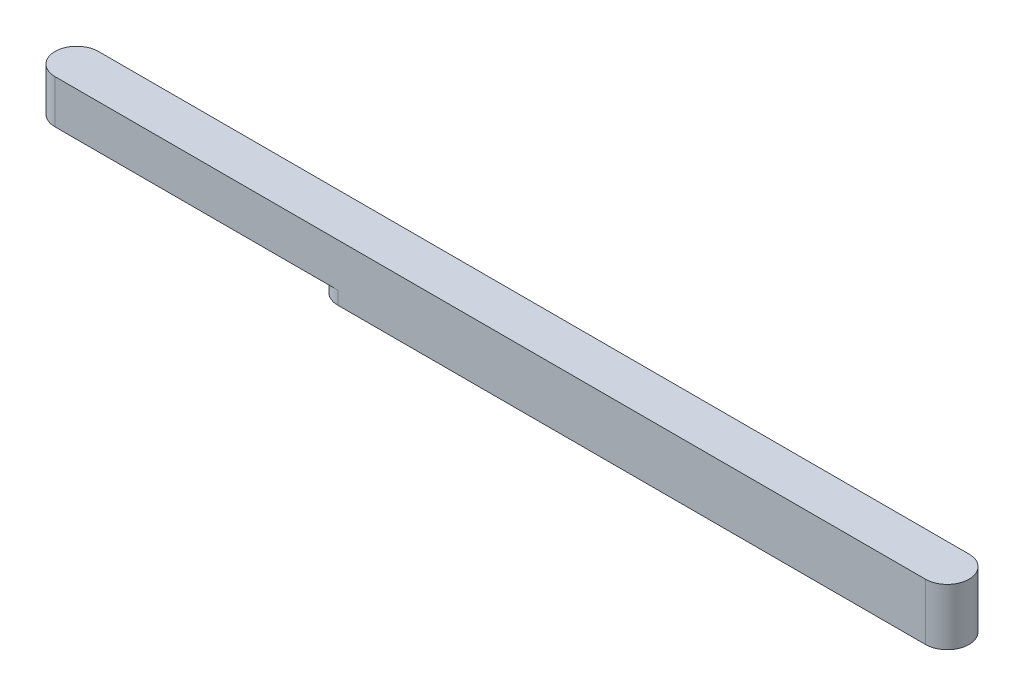
ISO-10303-21;
HEADER;
FILE_DESCRIPTION(('STEP AP214'),'2;1');
FILE_NAME('part.step','',(''),(''),'','','');
FILE_SCHEMA(('AUTOMOTIVE_DESIGN { 1 0 10303 214 1 1 1 1 }'));
ENDSEC;
DATA;
#1=APPLICATION_CONTEXT('core data for automotive mechanical design processes');
#2=APPLICATION_PROTOCOL_DEFINITION('international standard','automotive_design',2000,#1);
#3=PRODUCT_CONTEXT('',#1,'mechanical');
#4=PRODUCT('Part','Part','',(#3));
#5=PRODUCT_RELATED_PRODUCT_CATEGORY('part','',(#4));
#6=PRODUCT_DEFINITION_FORMATION('','',#4);
#7=PRODUCT_DEFINITION_CONTEXT('part definition',#1,'design');
#8=PRODUCT_DEFINITION('design','',#6,#7);
#9=PRODUCT_DEFINITION_SHAPE('','',#8);
#10=(LENGTH_UNIT() NAMED_UNIT(*) SI_UNIT(.MILLI.,.METRE.));
#11=(NAMED_UNIT(*) PLANE_ANGLE_UNIT() SI_UNIT($,.RADIAN.));
#12=(NAMED_UNIT(*) SI_UNIT($,.STERADIAN.) SOLID_ANGLE_UNIT());
#13=UNCERTAINTY_MEASURE_WITH_UNIT(LENGTH_MEASURE(1.E-05),#10,'distance_accuracy_value','');
#14=(GEOMETRIC_REPRESENTATION_CONTEXT(3) GLOBAL_UNCERTAINTY_ASSIGNED_CONTEXT((#13)) GLOBAL_UNIT_ASSIGNED_CONTEXT((#10,
#11,#12)) REPRESENTATION_CONTEXT('',''));
#15=CARTESIAN_POINT('',(0.,0.,0.));
#16=DIRECTION('',(0.,0.,1.));
#17=DIRECTION('',(1.,0.,0.));
#18=AXIS2_PLACEMENT_3D('',#15,#16,#17);
#19=CARTESIAN_POINT('',(-100.,5.,0.));
#20=DIRECTION('',(0.,-1.,0.));
#21=DIRECTION('',(0.,0.,-1.));
#22=AXIS2_PLACEMENT_3D('',#19,#20,#21);
#23=CYLINDRICAL_SURFACE('',#22,5.);
#24=CARTESIAN_POINT('',(-100.,-5.,0.));
#25=DIRECTION('',(0.,1.,0.));
#26=DIRECTION('',(0.,0.,1.));
#27=AXIS2_PLACEMENT_3D('',#24,#25,#26);
#28=CIRCLE('',#27,5.);
#29=CARTESIAN_POINT('',(-100.,-5.,-5.00000000000002));
#30=VERTEX_POINT('',#29);
#31=CARTESIAN_POINT('',(-100.,-5.,4.99999999999998));
#32=VERTEX_POINT('',#31);
#33=EDGE_CURVE('E203',#30,#32,#28,.T.);
#34=ORIENTED_EDGE('',*,*,#33,.T.);
#35=DIRECTION('',(0.,-1.,0.));
#36=VECTOR('',#35,1.);
#37=CARTESIAN_POINT('',(-100.,5.,4.99999999999998));
#38=LINE('',#37,#36);
#39=CARTESIAN_POINT('',(-100.,5.,4.99999999999998));
#40=VERTEX_POINT('',#39);
#41=EDGE_CURVE('E11',#40,#32,#38,.T.);
#42=ORIENTED_EDGE('',*,*,#41,.F.);
#43=CARTESIAN_POINT('',(-100.,5.,0.));
#44=DIRECTION('',(0.,1.,0.));
#45=DIRECTION('',(0.,0.,1.));
#46=AXIS2_PLACEMENT_3D('',#43,#44,#45);
#47=CIRCLE('',#46,5.);
#48=CARTESIAN_POINT('',(-100.,5.,-5.00000000000002));
#49=VERTEX_POINT('',#48);
#50=EDGE_CURVE('E303',#49,#40,#47,.T.);
#51=ORIENTED_EDGE('',*,*,#50,.F.);
#52=DIRECTION('',(0.,-1.,0.));
#53=VECTOR('',#52,1.);
#54=CARTESIAN_POINT('',(-100.,5.,-5.00000000000002));
#55=LINE('',#54,#53);
#56=EDGE_CURVE('E317',#49,#30,#55,.T.);
#57=ORIENTED_EDGE('',*,*,#56,.T.);
#58=EDGE_LOOP('',(#34,#42,#51,#57));
#59=FACE_BOUND('',#58,.T.);
#60=ADVANCED_FACE('F47',(#59),#23,.T.);
#61=CARTESIAN_POINT('',(-100.,5.,4.99999999999998));
#62=DIRECTION('',(0.,0.,-1.));
#63=DIRECTION('',(-1.,0.,0.));
#64=AXIS2_PLACEMENT_3D('',#61,#62,#63);
#65=PLANE('',#64);
#66=DIRECTION('',(1.,0.,0.));
#67=VECTOR('',#66,1.);
#68=CARTESIAN_POINT('',(-100.,-5.,4.99999999999998));
#69=LINE('',#68,#67);
#70=CARTESIAN_POINT('',(-35.,-5.,4.99999999999998));
#71=VERTEX_POINT('',#70);
#72=EDGE_CURVE('E321',#32,#71,#69,.T.);
#73=ORIENTED_EDGE('',*,*,#72,.T.);
#74=DIRECTION('',(0.,1.,0.));
#75=VECTOR('',#74,1.);
#76=CARTESIAN_POINT('',(-35.,-8.,4.99999999999999));
#77=LINE('',#76,#75);
#78=CARTESIAN_POINT('',(-35.,-8.,4.99999999999999));
#79=VERTEX_POINT('',#78);
#80=EDGE_CURVE('E194',#79,#71,#77,.T.);
#81=ORIENTED_EDGE('',*,*,#80,.F.);
#82=DIRECTION('',(-1.,0.,0.));
#83=VECTOR('',#82,1.);
#84=CARTESIAN_POINT('',(100.,-8.,5.00000000000001));
#85=LINE('',#84,#83);
#86=CARTESIAN_POINT('',(100.,-8.,5.00000000000001));
#87=VERTEX_POINT('',#86);
#88=EDGE_CURVE('E178',#87,#79,#85,.T.);
#89=ORIENTED_EDGE('',*,*,#88,.F.);
#90=DIRECTION('',(0.,-1.,0.));
#91=VECTOR('',#90,1.);
#92=CARTESIAN_POINT('',(100.,5.,5.));
#93=LINE('',#92,#91);
#94=CARTESIAN_POINT('',(100.,5.,5.));
#95=VERTEX_POINT('',#94);
#96=EDGE_CURVE('E55',#95,#87,#93,.T.);
#97=ORIENTED_EDGE('',*,*,#96,.F.);
#98=DIRECTION('',(1.,0.,0.));
#99=VECTOR('',#98,1.);
#100=CARTESIAN_POINT('',(-100.,5.,4.99999999999998));
#101=LINE('',#100,#99);
#102=EDGE_CURVE('E307',#40,#95,#101,.T.);
#103=ORIENTED_EDGE('',*,*,#102,.F.);
#104=ORIENTED_EDGE('',*,*,#41,.T.);
#105=EDGE_LOOP('',(#73,#81,#89,#97,#103,#104));
#106=FACE_BOUND('',#105,.T.);
#107=ADVANCED_FACE('F341',(#106),#65,.F.);
#108=CARTESIAN_POINT('',(100.,5.,0.));
#109=DIRECTION('',(0.,-1.,0.));
#110=DIRECTION('',(0.,0.,-1.));
#111=AXIS2_PLACEMENT_3D('',#108,#109,#110);
#112=CYLINDRICAL_SURFACE('',#111,5.);
#113=ORIENTED_EDGE('',*,*,#96,.T.);
#114=CARTESIAN_POINT('',(100.,-8.,0.));
#115=DIRECTION('',(0.,-1.,0.));
#116=DIRECTION('',(0.,0.,-1.));
#117=AXIS2_PLACEMENT_3D('',#114,#115,#116);
#118=CIRCLE('',#117,5.00000000000001);
#119=CARTESIAN_POINT('',(100.,-8.,-5.00000000000001));
#120=VERTEX_POINT('',#119);
#121=EDGE_CURVE('E174',#120,#87,#118,.T.);
#122=ORIENTED_EDGE('',*,*,#121,.F.);
#123=DIRECTION('',(0.,-1.,0.));
#124=VECTOR('',#123,1.);
#125=CARTESIAN_POINT('',(100.,5.,-5.00000000000002));
#126=LINE('',#125,#124);
#127=CARTESIAN_POINT('',(100.,5.,-5.00000000000002));
#128=VERTEX_POINT('',#127);
#129=EDGE_CURVE('E329',#128,#120,#126,.T.);
#130=ORIENTED_EDGE('',*,*,#129,.F.);
#131=CARTESIAN_POINT('',(100.,5.,0.));
#132=DIRECTION('',(0.,1.,0.));
#133=DIRECTION('',(0.,0.,1.));
#134=AXIS2_PLACEMENT_3D('',#131,#132,#133);
#135=CIRCLE('',#134,5.);
#136=EDGE_CURVE('E311',#95,#128,#135,.T.);
#137=ORIENTED_EDGE('',*,*,#136,.F.);
#138=EDGE_LOOP('',(#113,#122,#130,#137));
#139=FACE_BOUND('',#138,.T.);
#140=ADVANCED_FACE('F337',(#139),#112,.T.);
#141=CARTESIAN_POINT('',(-100.,5.,-5.00000000000002));
#142=DIRECTION('',(0.,0.,1.));
#143=DIRECTION('',(1.,0.,0.));
#144=AXIS2_PLACEMENT_3D('',#141,#142,#143);
#145=PLANE('',#144);
#146=ORIENTED_EDGE('',*,*,#129,.T.);
#147=DIRECTION('',(1.,0.,0.));
#148=VECTOR('',#147,1.);
#149=CARTESIAN_POINT('',(100.,-8.,-5.00000000000001));
#150=LINE('',#149,#148);
#151=CARTESIAN_POINT('',(-35.,-8.,-5.00000000000003));
#152=VERTEX_POINT('',#151);
#153=EDGE_CURVE('E184',#152,#120,#150,.T.);
#154=ORIENTED_EDGE('',*,*,#153,.F.);
#155=DIRECTION('',(0.,1.,0.));
#156=VECTOR('',#155,1.);
#157=CARTESIAN_POINT('',(-35.,-8.,-5.00000000000003));
#158=LINE('',#157,#156);
#159=CARTESIAN_POINT('',(-35.,-5.,-5.00000000000003));
#160=VERTEX_POINT('',#159);
#161=EDGE_CURVE('E188',#152,#160,#158,.T.);
#162=ORIENTED_EDGE('',*,*,#161,.T.);
#163=DIRECTION('',(-1.,0.,0.));
#164=VECTOR('',#163,1.);
#165=CARTESIAN_POINT('',(-100.,-5.,-5.00000000000002));
#166=LINE('',#165,#164);
#167=EDGE_CURVE('E308',#160,#30,#166,.T.);
#168=ORIENTED_EDGE('',*,*,#167,.T.);
#169=ORIENTED_EDGE('',*,*,#56,.F.);
#170=DIRECTION('',(-1.,0.,0.));
#171=VECTOR('',#170,1.);
#172=CARTESIAN_POINT('',(-100.,5.,-5.00000000000002));
#173=LINE('',#172,#171);
#174=EDGE_CURVE('E314',#128,#49,#173,.T.);
#175=ORIENTED_EDGE('',*,*,#174,.F.);
#176=EDGE_LOOP('',(#146,#154,#162,#168,#169,#175));
#177=FACE_BOUND('',#176,.T.);
#178=ADVANCED_FACE('F348',(#177),#145,.F.);
#179=CARTESIAN_POINT('',(-100.,5.,0.));
#180=DIRECTION('',(0.,1.,0.));
#181=DIRECTION('',(0.,0.,1.));
#182=AXIS2_PLACEMENT_3D('',#179,#180,#181);
#183=PLANE('',#182);
#184=ORIENTED_EDGE('',*,*,#50,.T.);
#185=ORIENTED_EDGE('',*,*,#102,.T.);
#186=ORIENTED_EDGE('',*,*,#136,.T.);
#187=ORIENTED_EDGE('',*,*,#174,.T.);
#188=EDGE_LOOP('',(#184,#185,#186,#187));
#189=FACE_BOUND('',#188,.T.);
#190=ADVANCED_FACE('F353',(#189),#183,.T.);
#191=CARTESIAN_POINT('',(-100.,-5.,0.));
#192=DIRECTION('',(0.,1.,0.));
#193=DIRECTION('',(0.,0.,1.));
#194=AXIS2_PLACEMENT_3D('',#191,#192,#193);
#195=PLANE('',#194);
#196=CARTESIAN_POINT('',(-35.,-5.,0.));
#197=DIRECTION('',(0.,-1.,0.));
#198=DIRECTION('',(0.,0.,-1.));
#199=AXIS2_PLACEMENT_3D('',#196,#197,#198);
#200=CIRCLE('',#199,5.00000000000001);
#201=EDGE_CURVE('E70',#71,#160,#200,.T.);
#202=ORIENTED_EDGE('',*,*,#201,.F.);
#203=ORIENTED_EDGE('',*,*,#72,.F.);
#204=ORIENTED_EDGE('',*,*,#33,.F.);
#205=ORIENTED_EDGE('',*,*,#167,.F.);
#206=EDGE_LOOP('',(#202,#203,#204,#205));
#207=FACE_BOUND('',#206,.T.);
#208=CARTESIAN_POINT('',(-90.,-5.,0.));
#209=DIRECTION('',(0.,-1.,0.));
#210=DIRECTION('',(0.,0.,-1.));
#211=AXIS2_PLACEMENT_3D('',#208,#209,#210);
#212=CIRCLE('',#211,0.515000000000001);
#213=CARTESIAN_POINT('',(-90.,-5.,-0.515000000000004));
#214=VERTEX_POINT('',#213);
#215=EDGE_CURVE('E204',#214,#214,#212,.T.);
#216=ORIENTED_EDGE('',*,*,#215,.F.);
#217=EDGE_LOOP('',(#216));
#218=FACE_BOUND('',#217,.T.);
#219=CARTESIAN_POINT('',(-88.036,-5.,0.));
#220=DIRECTION('',(0.,-1.,0.));
#221=DIRECTION('',(0.,0.,-1.));
#222=AXIS2_PLACEMENT_3D('',#219,#220,#221);
#223=CIRCLE('',#222,0.999999999999998);
#224=CARTESIAN_POINT('',(-88.036,-5.,-1.00000000000002));
#225=VERTEX_POINT('',#224);
#226=EDGE_CURVE('E208',#225,#225,#223,.T.);
#227=ORIENTED_EDGE('',*,*,#226,.F.);
#228=EDGE_LOOP('',(#227));
#229=FACE_BOUND('',#228,.T.);
#230=CARTESIAN_POINT('',(-86.072,-5.,0.));
#231=DIRECTION('',(0.,-1.,0.));
#232=DIRECTION('',(0.,0.,-1.));
#233=AXIS2_PLACEMENT_3D('',#230,#231,#232);
#234=CIRCLE('',#233,0.515000000000001);
#235=CARTESIAN_POINT('',(-86.072,-5.,-0.515000000000032));
#236=VERTEX_POINT('',#235);
#237=EDGE_CURVE('E216',#236,#236,#234,.T.);
#238=ORIENTED_EDGE('',*,*,#237,.F.);
#239=EDGE_LOOP('',(#238));
#240=FACE_BOUND('',#239,.T.);
#241=CARTESIAN_POINT('',(-84.108,-5.,0.));
#242=DIRECTION('',(0.,-1.,0.));
#243=DIRECTION('',(0.,0.,-1.));
#244=AXIS2_PLACEMENT_3D('',#241,#242,#243);
#245=CIRCLE('',#244,0.999999999999998);
#246=CARTESIAN_POINT('',(-84.108,-5.,-1.00000000000004));
#247=VERTEX_POINT('',#246);
#248=EDGE_CURVE('E224',#247,#247,#245,.T.);
#249=ORIENTED_EDGE('',*,*,#248,.F.);
#250=EDGE_LOOP('',(#249));
#251=FACE_BOUND('',#250,.T.);
#252=CARTESIAN_POINT('',(-82.144,-5.,0.));
#253=DIRECTION('',(0.,-1.,0.));
#254=DIRECTION('',(0.,0.,-1.));
#255=AXIS2_PLACEMENT_3D('',#252,#253,#254);
#256=CIRCLE('',#255,0.515000000000001);
#257=CARTESIAN_POINT('',(-82.144,-5.,-0.51500000000006));
#258=VERTEX_POINT('',#257);
#259=EDGE_CURVE('E232',#258,#258,#256,.T.);
#260=ORIENTED_EDGE('',*,*,#259,.F.);
#261=EDGE_LOOP('',(#260));
#262=FACE_BOUND('',#261,.T.);
#263=CARTESIAN_POINT('',(-80.18,-5.,0.));
#264=DIRECTION('',(0.,-1.,0.));
#265=DIRECTION('',(0.,0.,-1.));
#266=AXIS2_PLACEMENT_3D('',#263,#264,#265);
#267=CIRCLE('',#266,0.515000000000001);
#268=CARTESIAN_POINT('',(-80.18,-5.,-0.515000000000074));
#269=VERTEX_POINT('',#268);
#270=EDGE_CURVE('E240',#269,#269,#267,.T.);
#271=ORIENTED_EDGE('',*,*,#270,.F.);
#272=EDGE_LOOP('',(#271));
#273=FACE_BOUND('',#272,.T.);
#274=CARTESIAN_POINT('',(-75.93,-5.,0.));
#275=DIRECTION('',(0.,-1.,0.));
#276=DIRECTION('',(0.,0.,-1.));
#277=AXIS2_PLACEMENT_3D('',#274,#275,#276);
#278=CIRCLE('',#277,2.345);
#279=CARTESIAN_POINT('',(-75.93,-5.,-2.34500000000007));
#280=VERTEX_POINT('',#279);
#281=EDGE_CURVE('E248',#280,#280,#278,.T.);
#282=ORIENTED_EDGE('',*,*,#281,.F.);
#283=EDGE_LOOP('',(#282));
#284=FACE_BOUND('',#283,.T.);
#285=CARTESIAN_POINT('',(-71.68,-5.,0.));
#286=DIRECTION('',(0.,-1.,0.));
#287=DIRECTION('',(0.,0.,-1.));
#288=AXIS2_PLACEMENT_3D('',#285,#286,#287);
#289=CIRCLE('',#288,0.515000000000001);
#290=CARTESIAN_POINT('',(-71.68,-5.,-0.515000000000074));
#291=VERTEX_POINT('',#290);
#292=EDGE_CURVE('E256',#291,#291,#289,.T.);
#293=ORIENTED_EDGE('',*,*,#292,.F.);
#294=EDGE_LOOP('',(#293));
#295=FACE_BOUND('',#294,.T.);
#296=CARTESIAN_POINT('',(-69.716,-5.,0.));
#297=DIRECTION('',(0.,-1.,0.));
#298=DIRECTION('',(0.,0.,-1.));
#299=AXIS2_PLACEMENT_3D('',#296,#297,#298);
#300=CIRCLE('',#299,0.515000000000001);
#301=CARTESIAN_POINT('',(-69.716,-5.,-0.51500000000006));
#302=VERTEX_POINT('',#301);
#303=EDGE_CURVE('E264',#302,#302,#300,.T.);
#304=ORIENTED_EDGE('',*,*,#303,.F.);
#305=EDGE_LOOP('',(#304));
#306=FACE_BOUND('',#305,.T.);
#307=CARTESIAN_POINT('',(-67.752,-5.,0.));
#308=DIRECTION('',(0.,-1.,0.));
#309=DIRECTION('',(0.,0.,-1.));
#310=AXIS2_PLACEMENT_3D('',#307,#308,#309);
#311=CIRCLE('',#310,0.999999999999998);
#312=CARTESIAN_POINT('',(-67.752,-5.,-1.00000000000004));
#313=VERTEX_POINT('',#312);
#314=EDGE_CURVE('E272',#313,#313,#311,.T.);
#315=ORIENTED_EDGE('',*,*,#314,.F.);
#316=EDGE_LOOP('',(#315));
#317=FACE_BOUND('',#316,.T.);
#318=CARTESIAN_POINT('',(-65.788,-5.,0.));
#319=DIRECTION('',(0.,-1.,0.));
#320=DIRECTION('',(0.,0.,-1.));
#321=AXIS2_PLACEMENT_3D('',#318,#319,#320);
#322=CIRCLE('',#321,0.515000000000001);
#323=CARTESIAN_POINT('',(-65.788,-5.,-0.515000000000032));
#324=VERTEX_POINT('',#323);
#325=EDGE_CURVE('E280',#324,#324,#322,.T.);
#326=ORIENTED_EDGE('',*,*,#325,.F.);
#327=EDGE_LOOP('',(#326));
#328=FACE_BOUND('',#327,.T.);
#329=CARTESIAN_POINT('',(-61.86,-5.,0.));
#330=DIRECTION('',(0.,-1.,0.));
#331=DIRECTION('',(0.,0.,-1.));
#332=AXIS2_PLACEMENT_3D('',#329,#330,#331);
#333=CIRCLE('',#332,0.515000000000001);
#334=CARTESIAN_POINT('',(-61.86,-5.,-0.515000000000004));
#335=VERTEX_POINT('',#334);
#336=EDGE_CURVE('E288',#335,#335,#333,.T.);
#337=ORIENTED_EDGE('',*,*,#336,.F.);
#338=EDGE_LOOP('',(#337));
#339=FACE_BOUND('',#338,.T.);
#340=CARTESIAN_POINT('',(-63.824,-5.,0.));
#341=DIRECTION('',(0.,-1.,0.));
#342=DIRECTION('',(0.,0.,-1.));
#343=AXIS2_PLACEMENT_3D('',#340,#341,#342);
#344=CIRCLE('',#343,0.999999999999998);
#345=CARTESIAN_POINT('',(-63.824,-5.,-1.00000000000002));
#346=VERTEX_POINT('',#345);
#347=EDGE_CURVE('E296',#346,#346,#344,.T.);
#348=ORIENTED_EDGE('',*,*,#347,.F.);
#349=EDGE_LOOP('',(#348));
#350=FACE_BOUND('',#349,.T.);
#351=ADVANCED_FACE('F357',(#207,#218,#229,#240,#251,#262,#273,#284,#295,#306,#317,#328,#339,
#350),#195,.F.);
#352=CARTESIAN_POINT('',(-63.824,1.,0.));
#353=DIRECTION('',(0.,-1.,0.));
#354=DIRECTION('',(0.,0.,-1.));
#355=AXIS2_PLACEMENT_3D('',#352,#353,#354);
#356=CYLINDRICAL_SURFACE('',#355,0.999999999999998);
#357=CARTESIAN_POINT('',(-63.824,1.,0.));
#358=DIRECTION('',(0.,-1.,0.));
#359=DIRECTION('',(0.,0.,-1.));
#360=AXIS2_PLACEMENT_3D('',#357,#358,#359);
#361=CIRCLE('',#360,0.999999999999998);
#362=CARTESIAN_POINT('',(-63.824,1.,-1.00000000000002));
#363=VERTEX_POINT('',#362);
#364=EDGE_CURVE('E198',#363,#363,#361,.T.);
#365=ORIENTED_EDGE('',*,*,#364,.F.);
#366=EDGE_LOOP('',(#365));
#367=FACE_BOUND('',#366,.T.);
#368=ORIENTED_EDGE('',*,*,#347,.T.);
#369=EDGE_LOOP('',(#368));
#370=FACE_BOUND('',#369,.T.);
#371=ADVANCED_FACE('F387',(#367,#370),#356,.F.);
#372=CARTESIAN_POINT('',(-63.824,1.,0.));
#373=DIRECTION('',(0.,-1.,0.));
#374=DIRECTION('',(0.,0.,-1.));
#375=AXIS2_PLACEMENT_3D('',#372,#373,#374);
#376=PLANE('',#375);
#377=ORIENTED_EDGE('',*,*,#364,.T.);
#378=EDGE_LOOP('',(#377));
#379=FACE_BOUND('',#378,.T.);
#380=ADVANCED_FACE('F389',(#379),#376,.T.);
#381=CARTESIAN_POINT('',(-61.86,1.,0.));
#382=DIRECTION('',(0.,-1.,0.));
#383=DIRECTION('',(0.,0.,-1.));
#384=AXIS2_PLACEMENT_3D('',#381,#382,#383);
#385=CYLINDRICAL_SURFACE('',#384,0.515000000000001);
#386=CARTESIAN_POINT('',(-61.86,1.,0.));
#387=DIRECTION('',(0.,-1.,0.));
#388=DIRECTION('',(0.,0.,-1.));
#389=AXIS2_PLACEMENT_3D('',#386,#387,#388);
#390=CIRCLE('',#389,0.515000000000001);
#391=CARTESIAN_POINT('',(-61.86,1.,-0.515000000000004));
#392=VERTEX_POINT('',#391);
#393=EDGE_CURVE('E292',#392,#392,#390,.T.);
#394=ORIENTED_EDGE('',*,*,#393,.F.);
#395=EDGE_LOOP('',(#394));
#396=FACE_BOUND('',#395,.T.);
#397=ORIENTED_EDGE('',*,*,#336,.T.);
#398=EDGE_LOOP('',(#397));
#399=FACE_BOUND('',#398,.T.);
#400=ADVANCED_FACE('F392',(#396,#399),#385,.F.);
#401=CARTESIAN_POINT('',(0.,1.,0.));
#402=DIRECTION('',(0.,-1.,0.));
#403=DIRECTION('',(0.,0.,-1.));
#404=AXIS2_PLACEMENT_3D('',#401,#402,#403);
#405=PLANE('',#404);
#406=ORIENTED_EDGE('',*,*,#393,.T.);
#407=EDGE_LOOP('',(#406));
#408=FACE_BOUND('',#407,.T.);
#409=ADVANCED_FACE('F397',(#408),#405,.T.);
#410=CARTESIAN_POINT('',(-65.788,1.,0.));
#411=DIRECTION('',(0.,-1.,0.));
#412=DIRECTION('',(0.,0.,-1.));
#413=AXIS2_PLACEMENT_3D('',#410,#411,#412);
#414=CYLINDRICAL_SURFACE('',#413,0.515000000000001);
#415=CARTESIAN_POINT('',(-65.788,1.,0.));
#416=DIRECTION('',(0.,-1.,0.));
#417=DIRECTION('',(0.,0.,-1.));
#418=AXIS2_PLACEMENT_3D('',#415,#416,#417);
#419=CIRCLE('',#418,0.515000000000001);
#420=CARTESIAN_POINT('',(-65.788,1.,-0.515000000000032));
#421=VERTEX_POINT('',#420);
#422=EDGE_CURVE('E284',#421,#421,#419,.T.);
#423=ORIENTED_EDGE('',*,*,#422,.F.);
#424=EDGE_LOOP('',(#423));
#425=FACE_BOUND('',#424,.T.);
#426=ORIENTED_EDGE('',*,*,#325,.T.);
#427=EDGE_LOOP('',(#426));
#428=FACE_BOUND('',#427,.T.);
#429=ADVANCED_FACE('F400',(#425,#428),#414,.F.);
#430=CARTESIAN_POINT('',(0.,1.,0.));
#431=DIRECTION('',(0.,-1.,0.));
#432=DIRECTION('',(0.,0.,-1.));
#433=AXIS2_PLACEMENT_3D('',#430,#431,#432);
#434=PLANE('',#433);
#435=ORIENTED_EDGE('',*,*,#422,.T.);
#436=EDGE_LOOP('',(#435));
#437=FACE_BOUND('',#436,.T.);
#438=ADVANCED_FACE('F405',(#437),#434,.T.);
#439=CARTESIAN_POINT('',(-67.752,1.,0.));
#440=DIRECTION('',(0.,-1.,0.));
#441=DIRECTION('',(0.,0.,-1.));
#442=AXIS2_PLACEMENT_3D('',#439,#440,#441);
#443=CYLINDRICAL_SURFACE('',#442,0.999999999999998);
#444=CARTESIAN_POINT('',(-67.752,1.,0.));
#445=DIRECTION('',(0.,-1.,0.));
#446=DIRECTION('',(0.,0.,-1.));
#447=AXIS2_PLACEMENT_3D('',#444,#445,#446);
#448=CIRCLE('',#447,0.999999999999998);
#449=CARTESIAN_POINT('',(-67.752,1.,-1.00000000000004));
#450=VERTEX_POINT('',#449);
#451=EDGE_CURVE('E276',#450,#450,#448,.T.);
#452=ORIENTED_EDGE('',*,*,#451,.F.);
#453=EDGE_LOOP('',(#452));
#454=FACE_BOUND('',#453,.T.);
#455=ORIENTED_EDGE('',*,*,#314,.T.);
#456=EDGE_LOOP('',(#455));
#457=FACE_BOUND('',#456,.T.);
#458=ADVANCED_FACE('F408',(#454,#457),#443,.F.);
#459=CARTESIAN_POINT('',(0.,1.,0.));
#460=DIRECTION('',(0.,-1.,0.));
#461=DIRECTION('',(0.,0.,-1.));
#462=AXIS2_PLACEMENT_3D('',#459,#460,#461);
#463=PLANE('',#462);
#464=ORIENTED_EDGE('',*,*,#451,.T.);
#465=EDGE_LOOP('',(#464));
#466=FACE_BOUND('',#465,.T.);
#467=ADVANCED_FACE('F413',(#466),#463,.T.);
#468=CARTESIAN_POINT('',(-69.716,1.,0.));
#469=DIRECTION('',(0.,-1.,0.));
#470=DIRECTION('',(0.,0.,-1.));
#471=AXIS2_PLACEMENT_3D('',#468,#469,#470);
#472=CYLINDRICAL_SURFACE('',#471,0.515000000000001);
#473=CARTESIAN_POINT('',(-69.716,1.,0.));
#474=DIRECTION('',(0.,-1.,0.));
#475=DIRECTION('',(0.,0.,-1.));
#476=AXIS2_PLACEMENT_3D('',#473,#474,#475);
#477=CIRCLE('',#476,0.515000000000001);
#478=CARTESIAN_POINT('',(-69.716,1.,-0.51500000000006));
#479=VERTEX_POINT('',#478);
#480=EDGE_CURVE('E268',#479,#479,#477,.T.);
#481=ORIENTED_EDGE('',*,*,#480,.F.);
#482=EDGE_LOOP('',(#481));
#483=FACE_BOUND('',#482,.T.);
#484=ORIENTED_EDGE('',*,*,#303,.T.);
#485=EDGE_LOOP('',(#484));
#486=FACE_BOUND('',#485,.T.);
#487=ADVANCED_FACE('F416',(#483,#486),#472,.F.);
#488=CARTESIAN_POINT('',(0.,1.,0.));
#489=DIRECTION('',(0.,-1.,0.));
#490=DIRECTION('',(0.,0.,-1.));
#491=AXIS2_PLACEMENT_3D('',#488,#489,#490);
#492=PLANE('',#491);
#493=ORIENTED_EDGE('',*,*,#480,.T.);
#494=EDGE_LOOP('',(#493));
#495=FACE_BOUND('',#494,.T.);
#496=ADVANCED_FACE('F421',(#495),#492,.T.);
#497=CARTESIAN_POINT('',(-71.68,1.,0.));
#498=DIRECTION('',(0.,-1.,0.));
#499=DIRECTION('',(0.,0.,-1.));
#500=AXIS2_PLACEMENT_3D('',#497,#498,#499);
#501=CYLINDRICAL_SURFACE('',#500,0.515000000000001);
#502=CARTESIAN_POINT('',(-71.68,1.,0.));
#503=DIRECTION('',(0.,-1.,0.));
#504=DIRECTION('',(0.,0.,-1.));
#505=AXIS2_PLACEMENT_3D('',#502,#503,#504);
#506=CIRCLE('',#505,0.515000000000001);
#507=CARTESIAN_POINT('',(-71.68,1.,-0.515000000000074));
#508=VERTEX_POINT('',#507);
#509=EDGE_CURVE('E260',#508,#508,#506,.T.);
#510=ORIENTED_EDGE('',*,*,#509,.F.);
#511=EDGE_LOOP('',(#510));
#512=FACE_BOUND('',#511,.T.);
#513=ORIENTED_EDGE('',*,*,#292,.T.);
#514=EDGE_LOOP('',(#513));
#515=FACE_BOUND('',#514,.T.);
#516=ADVANCED_FACE('F424',(#512,#515),#501,.F.);
#517=CARTESIAN_POINT('',(0.,1.,0.));
#518=DIRECTION('',(0.,-1.,0.));
#519=DIRECTION('',(0.,0.,-1.));
#520=AXIS2_PLACEMENT_3D('',#517,#518,#519);
#521=PLANE('',#520);
#522=ORIENTED_EDGE('',*,*,#509,.T.);
#523=EDGE_LOOP('',(#522));
#524=FACE_BOUND('',#523,.T.);
#525=ADVANCED_FACE('F429',(#524),#521,.T.);
#526=CARTESIAN_POINT('',(-75.93,1.,0.));
#527=DIRECTION('',(0.,-1.,0.));
#528=DIRECTION('',(0.,0.,-1.));
#529=AXIS2_PLACEMENT_3D('',#526,#527,#528);
#530=CYLINDRICAL_SURFACE('',#529,2.345);
#531=CARTESIAN_POINT('',(-75.93,1.,0.));
#532=DIRECTION('',(0.,-1.,0.));
#533=DIRECTION('',(0.,0.,-1.));
#534=AXIS2_PLACEMENT_3D('',#531,#532,#533);
#535=CIRCLE('',#534,2.345);
#536=CARTESIAN_POINT('',(-75.93,1.,-2.34500000000007));
#537=VERTEX_POINT('',#536);
#538=EDGE_CURVE('E252',#537,#537,#535,.T.);
#539=ORIENTED_EDGE('',*,*,#538,.F.);
#540=EDGE_LOOP('',(#539));
#541=FACE_BOUND('',#540,.T.);
#542=ORIENTED_EDGE('',*,*,#281,.T.);
#543=EDGE_LOOP('',(#542));
#544=FACE_BOUND('',#543,.T.);
#545=ADVANCED_FACE('F432',(#541,#544),#530,.F.);
#546=CARTESIAN_POINT('',(0.,1.,0.));
#547=DIRECTION('',(0.,-1.,0.));
#548=DIRECTION('',(0.,0.,-1.));
#549=AXIS2_PLACEMENT_3D('',#546,#547,#548);
#550=PLANE('',#549);
#551=ORIENTED_EDGE('',*,*,#538,.T.);
#552=EDGE_LOOP('',(#551));
#553=FACE_BOUND('',#552,.T.);
#554=ADVANCED_FACE('F437',(#553),#550,.T.);
#555=CARTESIAN_POINT('',(-80.18,1.,0.));
#556=DIRECTION('',(0.,-1.,0.));
#557=DIRECTION('',(0.,0.,-1.));
#558=AXIS2_PLACEMENT_3D('',#555,#556,#557);
#559=CYLINDRICAL_SURFACE('',#558,0.515000000000001);
#560=CARTESIAN_POINT('',(-80.18,1.,0.));
#561=DIRECTION('',(0.,-1.,0.));
#562=DIRECTION('',(0.,0.,-1.));
#563=AXIS2_PLACEMENT_3D('',#560,#561,#562);
#564=CIRCLE('',#563,0.515000000000001);
#565=CARTESIAN_POINT('',(-80.18,1.,-0.515000000000074));
#566=VERTEX_POINT('',#565);
#567=EDGE_CURVE('E244',#566,#566,#564,.T.);
#568=ORIENTED_EDGE('',*,*,#567,.F.);
#569=EDGE_LOOP('',(#568));
#570=FACE_BOUND('',#569,.T.);
#571=ORIENTED_EDGE('',*,*,#270,.T.);
#572=EDGE_LOOP('',(#571));
#573=FACE_BOUND('',#572,.T.);
#574=ADVANCED_FACE('F440',(#570,#573),#559,.F.);
#575=CARTESIAN_POINT('',(0.,1.,0.));
#576=DIRECTION('',(0.,-1.,0.));
#577=DIRECTION('',(0.,0.,-1.));
#578=AXIS2_PLACEMENT_3D('',#575,#576,#577);
#579=PLANE('',#578);
#580=ORIENTED_EDGE('',*,*,#567,.T.);
#581=EDGE_LOOP('',(#580));
#582=FACE_BOUND('',#581,.T.);
#583=ADVANCED_FACE('F445',(#582),#579,.T.);
#584=CARTESIAN_POINT('',(-82.144,1.,0.));
#585=DIRECTION('',(0.,-1.,0.));
#586=DIRECTION('',(0.,0.,-1.));
#587=AXIS2_PLACEMENT_3D('',#584,#585,#586);
#588=CYLINDRICAL_SURFACE('',#587,0.515000000000001);
#589=CARTESIAN_POINT('',(-82.144,1.,0.));
#590=DIRECTION('',(0.,-1.,0.));
#591=DIRECTION('',(0.,0.,-1.));
#592=AXIS2_PLACEMENT_3D('',#589,#590,#591);
#593=CIRCLE('',#592,0.515000000000001);
#594=CARTESIAN_POINT('',(-82.144,1.,-0.51500000000006));
#595=VERTEX_POINT('',#594);
#596=EDGE_CURVE('E236',#595,#595,#593,.T.);
#597=ORIENTED_EDGE('',*,*,#596,.F.);
#598=EDGE_LOOP('',(#597));
#599=FACE_BOUND('',#598,.T.);
#600=ORIENTED_EDGE('',*,*,#259,.T.);
#601=EDGE_LOOP('',(#600));
#602=FACE_BOUND('',#601,.T.);
#603=ADVANCED_FACE('F448',(#599,#602),#588,.F.);
#604=CARTESIAN_POINT('',(0.,1.,0.));
#605=DIRECTION('',(0.,-1.,0.));
#606=DIRECTION('',(0.,0.,-1.));
#607=AXIS2_PLACEMENT_3D('',#604,#605,#606);
#608=PLANE('',#607);
#609=ORIENTED_EDGE('',*,*,#596,.T.);
#610=EDGE_LOOP('',(#609));
#611=FACE_BOUND('',#610,.T.);
#612=ADVANCED_FACE('F453',(#611),#608,.T.);
#613=CARTESIAN_POINT('',(-84.108,1.,0.));
#614=DIRECTION('',(0.,-1.,0.));
#615=DIRECTION('',(0.,0.,-1.));
#616=AXIS2_PLACEMENT_3D('',#613,#614,#615);
#617=CYLINDRICAL_SURFACE('',#616,0.999999999999998);
#618=CARTESIAN_POINT('',(-84.108,1.,0.));
#619=DIRECTION('',(0.,-1.,0.));
#620=DIRECTION('',(0.,0.,-1.));
#621=AXIS2_PLACEMENT_3D('',#618,#619,#620);
#622=CIRCLE('',#621,0.999999999999998);
#623=CARTESIAN_POINT('',(-84.108,1.,-1.00000000000004));
#624=VERTEX_POINT('',#623);
#625=EDGE_CURVE('E228',#624,#624,#622,.T.);
#626=ORIENTED_EDGE('',*,*,#625,.F.);
#627=EDGE_LOOP('',(#626));
#628=FACE_BOUND('',#627,.T.);
#629=ORIENTED_EDGE('',*,*,#248,.T.);
#630=EDGE_LOOP('',(#629));
#631=FACE_BOUND('',#630,.T.);
#632=ADVANCED_FACE('F456',(#628,#631),#617,.F.);
#633=CARTESIAN_POINT('',(0.,1.,0.));
#634=DIRECTION('',(0.,-1.,0.));
#635=DIRECTION('',(0.,0.,-1.));
#636=AXIS2_PLACEMENT_3D('',#633,#634,#635);
#637=PLANE('',#636);
#638=ORIENTED_EDGE('',*,*,#625,.T.);
#639=EDGE_LOOP('',(#638));
#640=FACE_BOUND('',#639,.T.);
#641=ADVANCED_FACE('F461',(#640),#637,.T.);
#642=CARTESIAN_POINT('',(-86.072,1.,0.));
#643=DIRECTION('',(0.,-1.,0.));
#644=DIRECTION('',(0.,0.,-1.));
#645=AXIS2_PLACEMENT_3D('',#642,#643,#644);
#646=CYLINDRICAL_SURFACE('',#645,0.515000000000001);
#647=CARTESIAN_POINT('',(-86.072,1.,0.));
#648=DIRECTION('',(0.,-1.,0.));
#649=DIRECTION('',(0.,0.,-1.));
#650=AXIS2_PLACEMENT_3D('',#647,#648,#649);
#651=CIRCLE('',#650,0.515000000000001);
#652=CARTESIAN_POINT('',(-86.072,1.,-0.515000000000032));
#653=VERTEX_POINT('',#652);
#654=EDGE_CURVE('E220',#653,#653,#651,.T.);
#655=ORIENTED_EDGE('',*,*,#654,.F.);
#656=EDGE_LOOP('',(#655));
#657=FACE_BOUND('',#656,.T.);
#658=ORIENTED_EDGE('',*,*,#237,.T.);
#659=EDGE_LOOP('',(#658));
#660=FACE_BOUND('',#659,.T.);
#661=ADVANCED_FACE('F464',(#657,#660),#646,.F.);
#662=CARTESIAN_POINT('',(0.,1.,0.));
#663=DIRECTION('',(0.,-1.,0.));
#664=DIRECTION('',(0.,0.,-1.));
#665=AXIS2_PLACEMENT_3D('',#662,#663,#664);
#666=PLANE('',#665);
#667=ORIENTED_EDGE('',*,*,#654,.T.);
#668=EDGE_LOOP('',(#667));
#669=FACE_BOUND('',#668,.T.);
#670=ADVANCED_FACE('F469',(#669),#666,.T.);
#671=CARTESIAN_POINT('',(-88.036,1.,0.));
#672=DIRECTION('',(0.,-1.,0.));
#673=DIRECTION('',(0.,0.,-1.));
#674=AXIS2_PLACEMENT_3D('',#671,#672,#673);
#675=CYLINDRICAL_SURFACE('',#674,0.999999999999998);
#676=CARTESIAN_POINT('',(-88.036,1.,0.));
#677=DIRECTION('',(0.,-1.,0.));
#678=DIRECTION('',(0.,0.,-1.));
#679=AXIS2_PLACEMENT_3D('',#676,#677,#678);
#680=CIRCLE('',#679,0.999999999999998);
#681=CARTESIAN_POINT('',(-88.036,1.,-1.00000000000002));
#682=VERTEX_POINT('',#681);
#683=EDGE_CURVE('E212',#682,#682,#680,.T.);
#684=ORIENTED_EDGE('',*,*,#683,.F.);
#685=EDGE_LOOP('',(#684));
#686=FACE_BOUND('',#685,.T.);
#687=ORIENTED_EDGE('',*,*,#226,.T.);
#688=EDGE_LOOP('',(#687));
#689=FACE_BOUND('',#688,.T.);
#690=ADVANCED_FACE('F472',(#686,#689),#675,.F.);
#691=CARTESIAN_POINT('',(0.,1.,0.));
#692=DIRECTION('',(0.,-1.,0.));
#693=DIRECTION('',(0.,0.,-1.));
#694=AXIS2_PLACEMENT_3D('',#691,#692,#693);
#695=PLANE('',#694);
#696=ORIENTED_EDGE('',*,*,#683,.T.);
#697=EDGE_LOOP('',(#696));
#698=FACE_BOUND('',#697,.T.);
#699=ADVANCED_FACE('F477',(#698),#695,.T.);
#700=CARTESIAN_POINT('',(-90.,1.,0.));
#701=DIRECTION('',(0.,-1.,0.));
#702=DIRECTION('',(0.,0.,-1.));
#703=AXIS2_PLACEMENT_3D('',#700,#701,#702);
#704=CYLINDRICAL_SURFACE('',#703,0.515000000000001);
#705=CARTESIAN_POINT('',(-90.,1.,0.));
#706=DIRECTION('',(0.,-1.,0.));
#707=DIRECTION('',(0.,0.,-1.));
#708=AXIS2_PLACEMENT_3D('',#705,#706,#707);
#709=CIRCLE('',#708,0.515000000000001);
#710=CARTESIAN_POINT('',(-90.,1.,-0.515000000000004));
#711=VERTEX_POINT('',#710);
#712=EDGE_CURVE('E199',#711,#711,#709,.T.);
#713=ORIENTED_EDGE('',*,*,#712,.F.);
#714=EDGE_LOOP('',(#713));
#715=FACE_BOUND('',#714,.T.);
#716=ORIENTED_EDGE('',*,*,#215,.T.);
#717=EDGE_LOOP('',(#716));
#718=FACE_BOUND('',#717,.T.);
#719=ADVANCED_FACE('F371',(#715,#718),#704,.F.);
#720=CARTESIAN_POINT('',(0.,1.,0.));
#721=DIRECTION('',(0.,-1.,0.));
#722=DIRECTION('',(0.,0.,-1.));
#723=AXIS2_PLACEMENT_3D('',#720,#721,#722);
#724=PLANE('',#723);
#725=ORIENTED_EDGE('',*,*,#712,.T.);
#726=EDGE_LOOP('',(#725));
#727=FACE_BOUND('',#726,.T.);
#728=ADVANCED_FACE('F362',(#727),#724,.T.);
#729=CARTESIAN_POINT('',(-35.,-8.,0.));
#730=DIRECTION('',(0.,1.,0.));
#731=DIRECTION('',(0.,0.,1.));
#732=AXIS2_PLACEMENT_3D('',#729,#730,#731);
#733=CYLINDRICAL_SURFACE('',#732,5.00000000000001);
#734=ORIENTED_EDGE('',*,*,#201,.T.);
#735=ORIENTED_EDGE('',*,*,#161,.F.);
#736=CARTESIAN_POINT('',(-35.,-8.,0.));
#737=DIRECTION('',(0.,-1.,0.));
#738=DIRECTION('',(0.,0.,-1.));
#739=AXIS2_PLACEMENT_3D('',#736,#737,#738);
#740=CIRCLE('',#739,5.00000000000001);
#741=EDGE_CURVE('E181',#79,#152,#740,.T.);
#742=ORIENTED_EDGE('',*,*,#741,.F.);
#743=ORIENTED_EDGE('',*,*,#80,.T.);
#744=EDGE_LOOP('',(#734,#735,#742,#743));
#745=FACE_BOUND('',#744,.T.);
#746=ADVANCED_FACE('F360',(#745),#733,.T.);
#747=CARTESIAN_POINT('',(100.,-8.,0.));
#748=DIRECTION('',(0.,-1.,0.));
#749=DIRECTION('',(0.,0.,-1.));
#750=AXIS2_PLACEMENT_3D('',#747,#748,#749);
#751=PLANE('',#750);
#752=CARTESIAN_POINT('',(-35.,-8.,0.));
#753=DIRECTION('',(0.,-1.,0.));
#754=DIRECTION('',(0.,0.,-1.));
#755=AXIS2_PLACEMENT_3D('',#752,#753,#754);
#756=CIRCLE('',#755,3.00000000000001);
#757=CARTESIAN_POINT('',(-35.,-8.,3.00000000000001));
#758=VERTEX_POINT('',#757);
#759=CARTESIAN_POINT('',(-35.,-8.,-3.00000000000001));
#760=VERTEX_POINT('',#759);
#761=EDGE_CURVE('E62',#758,#760,#756,.T.);
#762=ORIENTED_EDGE('',*,*,#761,.F.);
#763=DIRECTION('',(-1.,0.,0.));
#764=VECTOR('',#763,1.);
#765=CARTESIAN_POINT('',(-35.,-8.,3.00000000000001));
#766=LINE('',#765,#764);
#767=CARTESIAN_POINT('',(100.,-8.,3.00000000000001));
#768=VERTEX_POINT('',#767);
#769=EDGE_CURVE('E147',#768,#758,#766,.T.);
#770=ORIENTED_EDGE('',*,*,#769,.F.);
#771=CARTESIAN_POINT('',(100.,-8.,0.));
#772=DIRECTION('',(0.,-1.,0.));
#773=DIRECTION('',(0.,0.,-1.));
#774=AXIS2_PLACEMENT_3D('',#771,#772,#773);
#775=CIRCLE('',#774,3.00000000000001);
#776=CARTESIAN_POINT('',(100.,-8.,-3.00000000000001));
#777=VERTEX_POINT('',#776);
#778=EDGE_CURVE('E151',#777,#768,#775,.T.);
#779=ORIENTED_EDGE('',*,*,#778,.F.);
#780=DIRECTION('',(1.,0.,0.));
#781=VECTOR('',#780,1.);
#782=CARTESIAN_POINT('',(-35.,-8.,-3.00000000000001));
#783=LINE('',#782,#781);
#784=EDGE_CURVE('E160',#760,#777,#783,.T.);
#785=ORIENTED_EDGE('',*,*,#784,.F.);
#786=EDGE_LOOP('',(#762,#770,#779,#785));
#787=FACE_BOUND('',#786,.T.);
#788=ORIENTED_EDGE('',*,*,#121,.T.);
#789=ORIENTED_EDGE('',*,*,#88,.T.);
#790=ORIENTED_EDGE('',*,*,#741,.T.);
#791=ORIENTED_EDGE('',*,*,#153,.T.);
#792=EDGE_LOOP('',(#788,#789,#790,#791));
#793=FACE_BOUND('',#792,.T.);
#794=ADVANCED_FACE('F344',(#787,#793),#751,.T.);
#795=CARTESIAN_POINT('',(-35.,2.,0.));
#796=DIRECTION('',(0.,-1.,0.));
#797=DIRECTION('',(0.,0.,-1.));
#798=AXIS2_PLACEMENT_3D('',#795,#796,#797);
#799=CYLINDRICAL_SURFACE('',#798,3.00000000000001);
#800=ORIENTED_EDGE('',*,*,#761,.T.);
#801=DIRECTION('',(0.,-1.,0.));
#802=VECTOR('',#801,1.);
#803=CARTESIAN_POINT('',(-35.,2.,-3.00000000000001));
#804=LINE('',#803,#802);
#805=CARTESIAN_POINT('',(-35.,2.,-3.00000000000001));
#806=VERTEX_POINT('',#805);
#807=EDGE_CURVE('E122',#806,#760,#804,.T.);
#808=ORIENTED_EDGE('',*,*,#807,.F.);
#809=CARTESIAN_POINT('',(-35.,2.,0.));
#810=DIRECTION('',(0.,-1.,0.));
#811=DIRECTION('',(0.,0.,-1.));
#812=AXIS2_PLACEMENT_3D('',#809,#810,#811);
#813=CIRCLE('',#812,3.00000000000001);
#814=CARTESIAN_POINT('',(-35.,2.,3.00000000000001));
#815=VERTEX_POINT('',#814);
#816=EDGE_CURVE('E126',#815,#806,#813,.T.);
#817=ORIENTED_EDGE('',*,*,#816,.F.);
#818=DIRECTION('',(0.,-1.,0.));
#819=VECTOR('',#818,1.);
#820=CARTESIAN_POINT('',(-35.,2.,3.00000000000001));
#821=LINE('',#820,#819);
#822=EDGE_CURVE('E166',#815,#758,#821,.T.);
#823=ORIENTED_EDGE('',*,*,#822,.T.);
#824=EDGE_LOOP('',(#800,#808,#817,#823));
#825=FACE_BOUND('',#824,.T.);
#826=ADVANCED_FACE('F124',(#825),#799,.F.);
#827=CARTESIAN_POINT('',(-35.,2.,3.00000000000001));
#828=DIRECTION('',(0.,0.,1.));
#829=DIRECTION('',(1.,0.,0.));
#830=AXIS2_PLACEMENT_3D('',#827,#828,#829);
#831=PLANE('',#830);
#832=ORIENTED_EDGE('',*,*,#769,.T.);
#833=ORIENTED_EDGE('',*,*,#822,.F.);
#834=DIRECTION('',(-1.,0.,0.));
#835=VECTOR('',#834,1.);
#836=CARTESIAN_POINT('',(-35.,2.,3.00000000000001));
#837=LINE('',#836,#835);
#838=CARTESIAN_POINT('',(100.,2.,3.00000000000001));
#839=VERTEX_POINT('',#838);
#840=EDGE_CURVE('E133',#839,#815,#837,.T.);
#841=ORIENTED_EDGE('',*,*,#840,.F.);
#842=DIRECTION('',(0.,-1.,0.));
#843=VECTOR('',#842,1.);
#844=CARTESIAN_POINT('',(100.,2.,3.00000000000001));
#845=LINE('',#844,#843);
#846=EDGE_CURVE('E169',#839,#768,#845,.T.);
#847=ORIENTED_EDGE('',*,*,#846,.T.);
#848=EDGE_LOOP('',(#832,#833,#841,#847));
#849=FACE_BOUND('',#848,.T.);
#850=ADVANCED_FACE('F577',(#849),#831,.F.);
#851=CARTESIAN_POINT('',(100.,2.,0.));
#852=DIRECTION('',(0.,-1.,0.));
#853=DIRECTION('',(0.,0.,-1.));
#854=AXIS2_PLACEMENT_3D('',#851,#852,#853);
#855=CYLINDRICAL_SURFACE('',#854,3.00000000000001);
#856=ORIENTED_EDGE('',*,*,#778,.T.);
#857=ORIENTED_EDGE('',*,*,#846,.F.);
#858=CARTESIAN_POINT('',(100.,2.,0.));
#859=DIRECTION('',(0.,-1.,0.));
#860=DIRECTION('',(0.,0.,-1.));
#861=AXIS2_PLACEMENT_3D('',#858,#859,#860);
#862=CIRCLE('',#861,3.00000000000001);
#863=CARTESIAN_POINT('',(100.,2.,-3.00000000000001));
#864=VERTEX_POINT('',#863);
#865=EDGE_CURVE('E142',#864,#839,#862,.T.);
#866=ORIENTED_EDGE('',*,*,#865,.F.);
#867=DIRECTION('',(0.,-1.,0.));
#868=VECTOR('',#867,1.);
#869=CARTESIAN_POINT('',(100.,2.,-3.00000000000001));
#870=LINE('',#869,#868);
#871=EDGE_CURVE('E132',#864,#777,#870,.T.);
#872=ORIENTED_EDGE('',*,*,#871,.T.);
#873=EDGE_LOOP('',(#856,#857,#866,#872));
#874=FACE_BOUND('',#873,.T.);
#875=ADVANCED_FACE('F586',(#874),#855,.F.);
#876=CARTESIAN_POINT('',(-35.,2.,-3.00000000000001));
#877=DIRECTION('',(0.,0.,-1.));
#878=DIRECTION('',(-1.,0.,0.));
#879=AXIS2_PLACEMENT_3D('',#876,#877,#878);
#880=PLANE('',#879);
#881=ORIENTED_EDGE('',*,*,#784,.T.);
#882=ORIENTED_EDGE('',*,*,#871,.F.);
#883=DIRECTION('',(1.,0.,0.));
#884=VECTOR('',#883,1.);
#885=CARTESIAN_POINT('',(-35.,2.,-3.00000000000001));
#886=LINE('',#885,#884);
#887=EDGE_CURVE('E136',#806,#864,#886,.T.);
#888=ORIENTED_EDGE('',*,*,#887,.F.);
#889=ORIENTED_EDGE('',*,*,#807,.T.);
#890=EDGE_LOOP('',(#881,#882,#888,#889));
#891=FACE_BOUND('',#890,.T.);
#892=ADVANCED_FACE('F137',(#891),#880,.F.);
#893=CARTESIAN_POINT('',(-35.,2.,0.));
#894=DIRECTION('',(0.,-1.,0.));
#895=DIRECTION('',(0.,0.,-1.));
#896=AXIS2_PLACEMENT_3D('',#893,#894,#895);
#897=PLANE('',#896);
#898=ORIENTED_EDGE('',*,*,#816,.T.);
#899=ORIENTED_EDGE('',*,*,#887,.T.);
#900=ORIENTED_EDGE('',*,*,#865,.T.);
#901=ORIENTED_EDGE('',*,*,#840,.T.);
#902=EDGE_LOOP('',(#898,#899,#900,#901));
#903=FACE_BOUND('',#902,.T.);
#904=ADVANCED_FACE('F144',(#903),#897,.T.);
#905=CLOSED_SHELL('',(#60,#107,#140,#178,#190,#351,#371,#380,#400,#409,#429,#438,#458,#467,#487,
#496,#516,#525,#545,#554,#574,#583,#603,#612,#632,#641,#661,#670,#690,#699,#719,#728,#746,#794,
#826,#850,#875,#892,#904));
#906=MANIFOLD_SOLID_BREP('B2',#905);
#907=ADVANCED_BREP_SHAPE_REPRESENTATION('',(#18,#906),#14);
#908=SHAPE_DEFINITION_REPRESENTATION(#9,#907);
ENDSEC;
END-ISO-10303-21;
